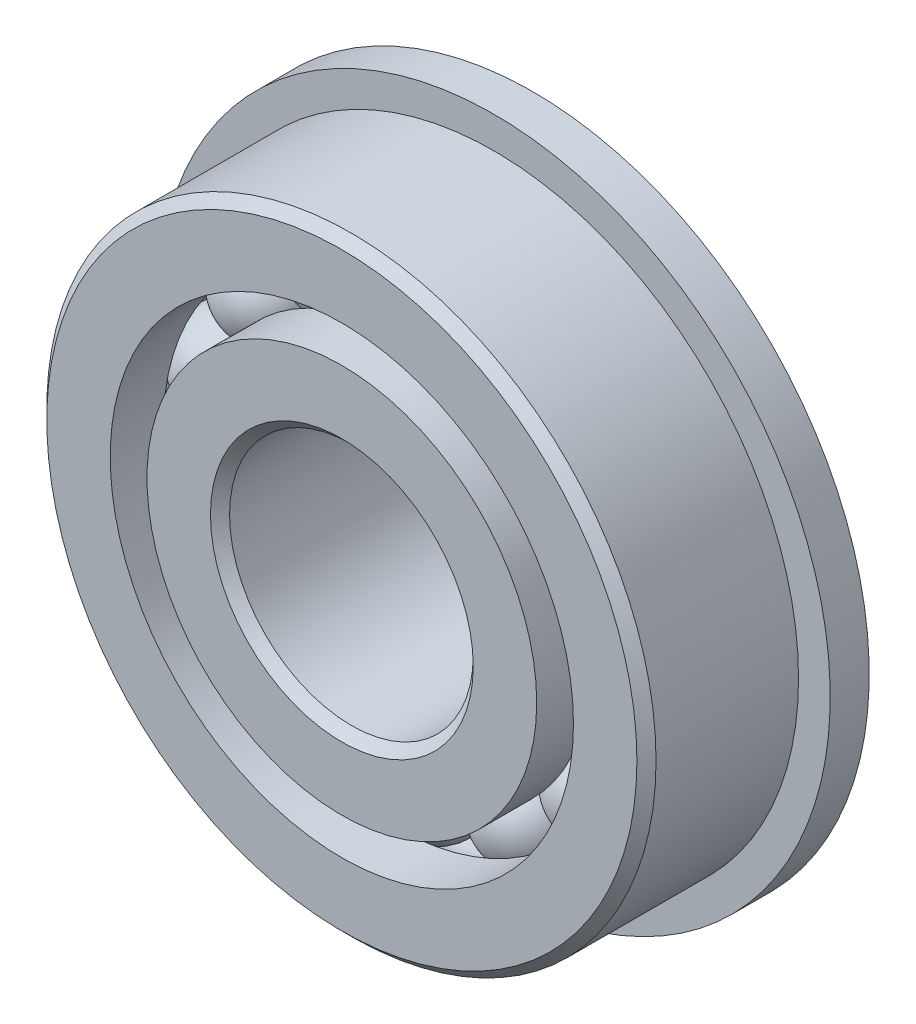
ISO-10303-21;
HEADER;
FILE_DESCRIPTION(('STEP AP214'),'2;1');
FILE_NAME('part.step','',(''),(''),'','','');
FILE_SCHEMA(('AUTOMOTIVE_DESIGN { 1 0 10303 214 1 1 1 1 }'));
ENDSEC;
DATA;
#1=APPLICATION_CONTEXT('core data for automotive mechanical design processes');
#2=APPLICATION_PROTOCOL_DEFINITION('international standard','automotive_design',2000,#1);
#3=PRODUCT_CONTEXT('',#1,'mechanical');
#4=PRODUCT('Part','Part','',(#3));
#5=PRODUCT_RELATED_PRODUCT_CATEGORY('part','',(#4));
#6=PRODUCT_DEFINITION_FORMATION('','',#4);
#7=PRODUCT_DEFINITION_CONTEXT('part definition',#1,'design');
#8=PRODUCT_DEFINITION('design','',#6,#7);
#9=PRODUCT_DEFINITION_SHAPE('','',#8);
#10=(LENGTH_UNIT() NAMED_UNIT(*) SI_UNIT(.MILLI.,.METRE.));
#11=(NAMED_UNIT(*) PLANE_ANGLE_UNIT() SI_UNIT($,.RADIAN.));
#12=(NAMED_UNIT(*) SI_UNIT($,.STERADIAN.) SOLID_ANGLE_UNIT());
#13=UNCERTAINTY_MEASURE_WITH_UNIT(LENGTH_MEASURE(1.E-05),#10,'distance_accuracy_value','');
#14=(GEOMETRIC_REPRESENTATION_CONTEXT(3) GLOBAL_UNCERTAINTY_ASSIGNED_CONTEXT((#13)) GLOBAL_UNIT_ASSIGNED_CONTEXT((#10,
#11,#12)) REPRESENTATION_CONTEXT('',''));
#15=CARTESIAN_POINT('',(0.,0.,0.));
#16=DIRECTION('',(0.,0.,1.));
#17=DIRECTION('',(1.,0.,0.));
#18=AXIS2_PLACEMENT_3D('',#15,#16,#17);
#19=CARTESIAN_POINT('',(-2.41076652547187,5.00600827228285,0.));
#20=DIRECTION('',(0.,0.,1.));
#21=DIRECTION('',(-0.433883739117546,0.900968867902425,0.));
#22=AXIS2_PLACEMENT_3D('',#19,#20,#21);
#23=SPHERICAL_SURFACE('',#22,1.20554465033679);
#24=CARTESIAN_POINT('',(-2.41076652547187,5.00600827228285,1.20554465033679));
#25=VERTEX_POINT('',#24);
#26=VERTEX_LOOP('',#25);
#27=FACE_BOUND('',#26,.T.);
#28=ADVANCED_FACE('F40',(#27),#23,.T.);
#29=CLOSED_SHELL('',(#28));
#30=MANIFOLD_SOLID_BREP('B2',#29);
#31=CARTESIAN_POINT('',(-4.34405117446295,3.46426521157764,0.));
#32=DIRECTION('',(0.,0.,1.));
#33=DIRECTION('',(-0.781831482468022,0.623489801858743,0.));
#34=AXIS2_PLACEMENT_3D('',#31,#32,#33);
#35=SPHERICAL_SURFACE('',#34,1.20554465033679);
#36=CARTESIAN_POINT('',(-4.34405117446295,3.46426521157764,1.20554465033679));
#37=VERTEX_POINT('',#36);
#38=VERTEX_LOOP('',#37);
#39=FACE_BOUND('',#38,.T.);
#40=ADVANCED_FACE('F61',(#39),#35,.T.);
#41=CLOSED_SHELL('',(#40));
#42=MANIFOLD_SOLID_BREP('B6',#41);
#43=CARTESIAN_POINT('',(-5.41694321206024,1.23638193929483,0.));
#44=DIRECTION('',(0.,0.,1.));
#45=DIRECTION('',(-0.974927912181821,0.222520933956325,0.));
#46=AXIS2_PLACEMENT_3D('',#43,#44,#45);
#47=SPHERICAL_SURFACE('',#46,1.20554465033679);
#48=CARTESIAN_POINT('',(-5.41694321206024,1.23638193929483,1.20554465033679));
#49=VERTEX_POINT('',#48);
#50=VERTEX_LOOP('',#49);
#51=FACE_BOUND('',#50,.T.);
#52=ADVANCED_FACE('F82',(#51),#47,.T.);
#53=CLOSED_SHELL('',(#52));
#54=MANIFOLD_SOLID_BREP('B36',#53);
#55=CARTESIAN_POINT('',(-5.41694321206027,-1.23638193929472,0.));
#56=DIRECTION('',(0.,0.,1.));
#57=DIRECTION('',(-0.974927912181826,-0.222520933956305,0.));
#58=AXIS2_PLACEMENT_3D('',#55,#56,#57);
#59=SPHERICAL_SURFACE('',#58,1.20554465033679);
#60=CARTESIAN_POINT('',(-5.41694321206027,-1.23638193929472,1.20554465033679));
#61=VERTEX_POINT('',#60);
#62=VERTEX_LOOP('',#61);
#63=FACE_BOUND('',#62,.T.);
#64=ADVANCED_FACE('F103',(#63),#59,.T.);
#65=CLOSED_SHELL('',(#64));
#66=MANIFOLD_SOLID_BREP('B57',#65);
#67=CARTESIAN_POINT('',(-4.34405117446302,-3.46426521157755,0.));
#68=DIRECTION('',(0.,0.,1.));
#69=DIRECTION('',(-0.781831482468035,-0.623489801858727,0.));
#70=AXIS2_PLACEMENT_3D('',#67,#68,#69);
#71=SPHERICAL_SURFACE('',#70,1.20554465033679);
#72=CARTESIAN_POINT('',(-4.34405117446302,-3.46426521157755,1.20554465033679));
#73=VERTEX_POINT('',#72);
#74=VERTEX_LOOP('',#73);
#75=FACE_BOUND('',#74,.T.);
#76=ADVANCED_FACE('F124',(#75),#71,.T.);
#77=CLOSED_SHELL('',(#76));
#78=MANIFOLD_SOLID_BREP('B78',#77);
#79=CARTESIAN_POINT('',(-2.41076652547197,-5.0060082722828,0.));
#80=DIRECTION('',(0.,0.,1.));
#81=DIRECTION('',(-0.433883739117565,-0.900968867902416,0.));
#82=AXIS2_PLACEMENT_3D('',#79,#80,#81);
#83=SPHERICAL_SURFACE('',#82,1.20554465033679);
#84=CARTESIAN_POINT('',(-2.41076652547197,-5.0060082722828,1.20554465033679));
#85=VERTEX_POINT('',#84);
#86=VERTEX_LOOP('',#85);
#87=FACE_BOUND('',#86,.T.);
#88=ADVANCED_FACE('F145',(#87),#83,.T.);
#89=CLOSED_SHELL('',(#88));
#90=MANIFOLD_SOLID_BREP('B99',#89);
#91=CARTESIAN_POINT('',(0.,-5.55625,0.));
#92=DIRECTION('',(0.,0.,1.));
#93=DIRECTION('',(0.,-1.,0.));
#94=AXIS2_PLACEMENT_3D('',#91,#92,#93);
#95=SPHERICAL_SURFACE('',#94,1.20554465033679);
#96=CARTESIAN_POINT('',(0.,-5.55625,1.20554465033679));
#97=VERTEX_POINT('',#96);
#98=VERTEX_LOOP('',#97);
#99=FACE_BOUND('',#98,.T.);
#100=ADVANCED_FACE('F166',(#99),#95,.T.);
#101=CLOSED_SHELL('',(#100));
#102=MANIFOLD_SOLID_BREP('B120',#101);
#103=CARTESIAN_POINT('',(2.4107665254719,-5.00600827228283,0.));
#104=DIRECTION('',(0.,0.,1.));
#105=DIRECTION('',(0.433883739117553,-0.900968867902422,0.));
#106=AXIS2_PLACEMENT_3D('',#103,#104,#105);
#107=SPHERICAL_SURFACE('',#106,1.20554465033679);
#108=CARTESIAN_POINT('',(2.4107665254719,-5.00600827228283,1.20554465033679));
#109=VERTEX_POINT('',#108);
#110=VERTEX_LOOP('',#109);
#111=FACE_BOUND('',#110,.T.);
#112=ADVANCED_FACE('F187',(#111),#107,.T.);
#113=CLOSED_SHELL('',(#112));
#114=MANIFOLD_SOLID_BREP('B141',#113);
#115=CARTESIAN_POINT('',(4.34405117446297,-3.46426521157761,0.));
#116=DIRECTION('',(0.,0.,1.));
#117=DIRECTION('',(0.781831482468027,-0.623489801858737,0.));
#118=AXIS2_PLACEMENT_3D('',#115,#116,#117);
#119=SPHERICAL_SURFACE('',#118,1.20554465033679);
#120=CARTESIAN_POINT('',(4.34405117446297,-3.46426521157761,1.20554465033679));
#121=VERTEX_POINT('',#120);
#122=VERTEX_LOOP('',#121);
#123=FACE_BOUND('',#122,.T.);
#124=ADVANCED_FACE('F208',(#123),#119,.T.);
#125=CLOSED_SHELL('',(#124));
#126=MANIFOLD_SOLID_BREP('B162',#125);
#127=CARTESIAN_POINT('',(5.41694321206025,-1.23638193929479,0.));
#128=DIRECTION('',(0.,0.,1.));
#129=DIRECTION('',(0.974927912181823,-0.222520933956318,0.));
#130=AXIS2_PLACEMENT_3D('',#127,#128,#129);
#131=SPHERICAL_SURFACE('',#130,1.20554465033679);
#132=CARTESIAN_POINT('',(5.41694321206025,-1.23638193929479,1.20554465033679));
#133=VERTEX_POINT('',#132);
#134=VERTEX_LOOP('',#133);
#135=FACE_BOUND('',#134,.T.);
#136=ADVANCED_FACE('F229',(#135),#131,.T.);
#137=CLOSED_SHELL('',(#136));
#138=MANIFOLD_SOLID_BREP('B183',#137);
#139=CARTESIAN_POINT('',(5.41694321206026,1.23638193929476,0.));
#140=DIRECTION('',(0.,0.,1.));
#141=DIRECTION('',(0.974927912181824,0.222520933956311,0.));
#142=AXIS2_PLACEMENT_3D('',#139,#140,#141);
#143=SPHERICAL_SURFACE('',#142,1.20554465033679);
#144=CARTESIAN_POINT('',(5.41694321206026,1.23638193929476,1.20554465033679));
#145=VERTEX_POINT('',#144);
#146=VERTEX_LOOP('',#145);
#147=FACE_BOUND('',#146,.T.);
#148=ADVANCED_FACE('F250',(#147),#143,.T.);
#149=CLOSED_SHELL('',(#148));
#150=MANIFOLD_SOLID_BREP('B204',#149);
#151=CARTESIAN_POINT('',(4.344051174463,3.46426521157758,0.));
#152=DIRECTION('',(0.,0.,1.));
#153=DIRECTION('',(0.781831482468031,0.623489801858732,0.));
#154=AXIS2_PLACEMENT_3D('',#151,#152,#153);
#155=SPHERICAL_SURFACE('',#154,1.20554465033679);
#156=CARTESIAN_POINT('',(4.344051174463,3.46426521157758,1.20554465033679));
#157=VERTEX_POINT('',#156);
#158=VERTEX_LOOP('',#157);
#159=FACE_BOUND('',#158,.T.);
#160=ADVANCED_FACE('F271',(#159),#155,.T.);
#161=CLOSED_SHELL('',(#160));
#162=MANIFOLD_SOLID_BREP('B225',#161);
#163=CARTESIAN_POINT('',(2.41076652547194,5.00600827228281,0.));
#164=DIRECTION('',(0.,0.,1.));
#165=DIRECTION('',(0.433883739117559,0.900968867902419,0.));
#166=AXIS2_PLACEMENT_3D('',#163,#164,#165);
#167=SPHERICAL_SURFACE('',#166,1.20554465033679);
#168=CARTESIAN_POINT('',(2.41076652547194,5.00600827228281,1.20554465033679));
#169=VERTEX_POINT('',#168);
#170=VERTEX_LOOP('',#169);
#171=FACE_BOUND('',#170,.T.);
#172=ADVANCED_FACE('F292',(#171),#167,.T.);
#173=CLOSED_SHELL('',(#172));
#174=MANIFOLD_SOLID_BREP('B246',#173);
#175=CARTESIAN_POINT('',(0.,5.55625,0.));
#176=DIRECTION('',(0.,0.,1.));
#177=DIRECTION('',(0.,1.,0.));
#178=AXIS2_PLACEMENT_3D('',#175,#176,#177);
#179=SPHERICAL_SURFACE('',#178,1.20554465033679);
#180=CARTESIAN_POINT('',(0.,5.55625,1.20554465033679));
#181=VERTEX_POINT('',#180);
#182=VERTEX_LOOP('',#181);
#183=FACE_BOUND('',#182,.T.);
#184=ADVANCED_FACE('F315',(#183),#179,.T.);
#185=CLOSED_SHELL('',(#184));
#186=MANIFOLD_SOLID_BREP('B267',#185);
#187=CARTESIAN_POINT('',(0.,5.07727857142857,2.4892));
#188=DIRECTION('',(0.,0.,-1.));
#189=DIRECTION('',(-1.,0.,0.));
#190=AXIS2_PLACEMENT_3D('',#187,#188,#189);
#191=PLANE('',#190);
#192=CARTESIAN_POINT('',(0.,0.,2.4892));
#193=DIRECTION('',(0.,0.,1.));
#194=DIRECTION('',(1.,0.,0.));
#195=AXIS2_PLACEMENT_3D('',#192,#193,#194);
#196=CIRCLE('',#195,3.42392);
#197=CARTESIAN_POINT('',(3.42392,0.,2.4892));
#198=VERTEX_POINT('',#197);
#199=EDGE_CURVE('E363',#198,#198,#196,.T.);
#200=ORIENTED_EDGE('',*,*,#199,.F.);
#201=EDGE_LOOP('',(#200));
#202=FACE_BOUND('',#201,.T.);
#203=CARTESIAN_POINT('',(0.,0.,2.4892));
#204=DIRECTION('',(0.,0.,1.));
#205=DIRECTION('',(1.,0.,0.));
#206=AXIS2_PLACEMENT_3D('',#203,#204,#205);
#207=CIRCLE('',#206,5.07727857142857);
#208=CARTESIAN_POINT('',(5.07727857142857,0.,2.4892));
#209=VERTEX_POINT('',#208);
#210=EDGE_CURVE('E314',#209,#209,#207,.T.);
#211=ORIENTED_EDGE('',*,*,#210,.T.);
#212=EDGE_LOOP('',(#211));
#213=FACE_BOUND('',#212,.T.);
#214=ADVANCED_FACE('F335',(#202,#213),#191,.F.);
#215=CARTESIAN_POINT('',(0.,0.,2.4892));
#216=DIRECTION('',(0.,0.,1.));
#217=DIRECTION('',(1.,0.,0.));
#218=AXIS2_PLACEMENT_3D('',#215,#216,#217);
#219=CYLINDRICAL_SURFACE('',#218,5.07727857142857);
#220=ORIENTED_EDGE('',*,*,#210,.F.);
#221=EDGE_LOOP('',(#220));
#222=FACE_BOUND('',#221,.T.);
#223=CARTESIAN_POINT('',(0.,0.,1.10631111111111));
#224=DIRECTION('',(0.,0.,1.));
#225=DIRECTION('',(1.,0.,0.));
#226=AXIS2_PLACEMENT_3D('',#223,#224,#225);
#227=CIRCLE('',#226,5.07727857142857);
#228=CARTESIAN_POINT('',(5.07727857142857,0.,1.10631111111111));
#229=VERTEX_POINT('',#228);
#230=EDGE_CURVE('E341',#229,#229,#227,.T.);
#231=ORIENTED_EDGE('',*,*,#230,.T.);
#232=EDGE_LOOP('',(#231));
#233=FACE_BOUND('',#232,.T.);
#234=ADVANCED_FACE('F370',(#222,#233),#219,.T.);
#235=CARTESIAN_POINT('',(0.,0.,0.));
#236=DIRECTION('',(0.,0.,1.));
#237=DIRECTION('',(1.,0.,0.));
#238=AXIS2_PLACEMENT_3D('',#235,#236,#237);
#239=TOROIDAL_SURFACE('',#238,5.55625,1.20554465033679);
#240=ORIENTED_EDGE('',*,*,#230,.F.);
#241=EDGE_LOOP('',(#240));
#242=FACE_BOUND('',#241,.T.);
#243=CARTESIAN_POINT('',(0.,0.,-1.10631111111111));
#244=DIRECTION('',(0.,0.,1.));
#245=DIRECTION('',(1.,0.,0.));
#246=AXIS2_PLACEMENT_3D('',#243,#244,#245);
#247=CIRCLE('',#246,5.07727857142857);
#248=CARTESIAN_POINT('',(5.07727857142857,0.,-1.10631111111111));
#249=VERTEX_POINT('',#248);
#250=EDGE_CURVE('E345',#249,#249,#247,.T.);
#251=ORIENTED_EDGE('',*,*,#250,.T.);
#252=EDGE_LOOP('',(#251));
#253=FACE_BOUND('',#252,.T.);
#254=ADVANCED_FACE('F374',(#242,#253),#239,.F.);
#255=CARTESIAN_POINT('',(0.,0.,2.4892));
#256=DIRECTION('',(0.,0.,1.));
#257=DIRECTION('',(1.,0.,0.));
#258=AXIS2_PLACEMENT_3D('',#255,#256,#257);
#259=CYLINDRICAL_SURFACE('',#258,5.07727857142857);
#260=ORIENTED_EDGE('',*,*,#250,.F.);
#261=EDGE_LOOP('',(#260));
#262=FACE_BOUND('',#261,.T.);
#263=CARTESIAN_POINT('',(0.,0.,-2.4892));
#264=DIRECTION('',(0.,0.,1.));
#265=DIRECTION('',(1.,0.,0.));
#266=AXIS2_PLACEMENT_3D('',#263,#264,#265);
#267=CIRCLE('',#266,5.07727857142857);
#268=CARTESIAN_POINT('',(5.07727857142857,0.,-2.4892));
#269=VERTEX_POINT('',#268);
#270=EDGE_CURVE('E349',#269,#269,#267,.T.);
#271=ORIENTED_EDGE('',*,*,#270,.T.);
#272=EDGE_LOOP('',(#271));
#273=FACE_BOUND('',#272,.T.);
#274=ADVANCED_FACE('F379',(#262,#273),#259,.T.);
#275=CARTESIAN_POINT('',(0.,3.42392,-2.4892));
#276=DIRECTION('',(0.,0.,1.));
#277=DIRECTION('',(1.,0.,0.));
#278=AXIS2_PLACEMENT_3D('',#275,#276,#277);
#279=PLANE('',#278);
#280=ORIENTED_EDGE('',*,*,#270,.F.);
#281=EDGE_LOOP('',(#280));
#282=FACE_BOUND('',#281,.T.);
#283=CARTESIAN_POINT('',(0.,0.,-2.4892));
#284=DIRECTION('',(0.,0.,1.));
#285=DIRECTION('',(1.,0.,0.));
#286=AXIS2_PLACEMENT_3D('',#283,#284,#285);
#287=CIRCLE('',#286,3.42392);
#288=CARTESIAN_POINT('',(3.42392,0.,-2.4892));
#289=VERTEX_POINT('',#288);
#290=EDGE_CURVE('E354',#289,#289,#287,.T.);
#291=ORIENTED_EDGE('',*,*,#290,.T.);
#292=EDGE_LOOP('',(#291));
#293=FACE_BOUND('',#292,.T.);
#294=ADVANCED_FACE('F385',(#282,#293),#279,.F.);
#295=CARTESIAN_POINT('',(0.,0.,-2.24028));
#296=DIRECTION('',(0.,0.,-1.));
#297=DIRECTION('',(-1.,0.,0.));
#298=AXIS2_PLACEMENT_3D('',#295,#296,#297);
#299=CONICAL_SURFACE('',#298,3.175,0.785398163397447);
#300=ORIENTED_EDGE('',*,*,#290,.F.);
#301=EDGE_LOOP('',(#300));
#302=FACE_BOUND('',#301,.T.);
#303=CARTESIAN_POINT('',(0.,0.,-2.24028));
#304=DIRECTION('',(0.,0.,1.));
#305=DIRECTION('',(1.,0.,0.));
#306=AXIS2_PLACEMENT_3D('',#303,#304,#305);
#307=CIRCLE('',#306,3.175);
#308=CARTESIAN_POINT('',(3.175,0.,-2.24028));
#309=VERTEX_POINT('',#308);
#310=EDGE_CURVE('E357',#309,#309,#307,.T.);
#311=ORIENTED_EDGE('',*,*,#310,.T.);
#312=EDGE_LOOP('',(#311));
#313=FACE_BOUND('',#312,.T.);
#314=ADVANCED_FACE('F389',(#302,#313),#299,.F.);
#315=CARTESIAN_POINT('',(0.,0.,2.4892));
#316=DIRECTION('',(0.,0.,1.));
#317=DIRECTION('',(1.,0.,0.));
#318=AXIS2_PLACEMENT_3D('',#315,#316,#317);
#319=CYLINDRICAL_SURFACE('',#318,3.175);
#320=ORIENTED_EDGE('',*,*,#310,.F.);
#321=EDGE_LOOP('',(#320));
#322=FACE_BOUND('',#321,.T.);
#323=CARTESIAN_POINT('',(0.,0.,2.24028));
#324=DIRECTION('',(0.,0.,1.));
#325=DIRECTION('',(1.,0.,0.));
#326=AXIS2_PLACEMENT_3D('',#323,#324,#325);
#327=CIRCLE('',#326,3.175);
#328=CARTESIAN_POINT('',(3.175,0.,2.24028));
#329=VERTEX_POINT('',#328);
#330=EDGE_CURVE('E360',#329,#329,#327,.T.);
#331=ORIENTED_EDGE('',*,*,#330,.T.);
#332=EDGE_LOOP('',(#331));
#333=FACE_BOUND('',#332,.T.);
#334=ADVANCED_FACE('F393',(#322,#333),#319,.F.);
#335=CARTESIAN_POINT('',(0.,0.,2.4892));
#336=DIRECTION('',(0.,0.,1.));
#337=DIRECTION('',(1.,0.,0.));
#338=AXIS2_PLACEMENT_3D('',#335,#336,#337);
#339=CONICAL_SURFACE('',#338,3.42392,0.785398163397448);
#340=ORIENTED_EDGE('',*,*,#330,.F.);
#341=EDGE_LOOP('',(#340));
#342=FACE_BOUND('',#341,.T.);
#343=ORIENTED_EDGE('',*,*,#199,.T.);
#344=EDGE_LOOP('',(#343));
#345=FACE_BOUND('',#344,.T.);
#346=ADVANCED_FACE('F367',(#342,#345),#339,.F.);
#347=CLOSED_SHELL('',(#214,#234,#254,#274,#294,#314,#334,#346));
#348=MANIFOLD_SOLID_BREP('B288',#347);
#349=CARTESIAN_POINT('',(0.,0.,2.24028));
#350=DIRECTION('',(0.,0.,-1.));
#351=DIRECTION('',(-1.,0.,0.));
#352=AXIS2_PLACEMENT_3D('',#349,#350,#351);
#353=CONICAL_SURFACE('',#352,7.9375,0.785398163397448);
#354=CARTESIAN_POINT('',(0.,0.,2.4892));
#355=DIRECTION('',(0.,0.,1.));
#356=DIRECTION('',(1.,0.,0.));
#357=AXIS2_PLACEMENT_3D('',#354,#355,#356);
#358=CIRCLE('',#357,7.68858);
#359=CARTESIAN_POINT('',(7.68858,0.,2.4892));
#360=VERTEX_POINT('',#359);
#361=EDGE_CURVE('E479',#360,#360,#358,.T.);
#362=ORIENTED_EDGE('',*,*,#361,.F.);
#363=EDGE_LOOP('',(#362));
#364=FACE_BOUND('',#363,.T.);
#365=CARTESIAN_POINT('',(0.,0.,2.24028));
#366=DIRECTION('',(0.,0.,1.));
#367=DIRECTION('',(1.,0.,0.));
#368=AXIS2_PLACEMENT_3D('',#365,#366,#367);
#369=CIRCLE('',#368,7.9375);
#370=CARTESIAN_POINT('',(7.9375,0.,2.24028));
#371=VERTEX_POINT('',#370);
#372=EDGE_CURVE('E334',#371,#371,#369,.T.);
#373=ORIENTED_EDGE('',*,*,#372,.T.);
#374=EDGE_LOOP('',(#373));
#375=FACE_BOUND('',#374,.T.);
#376=ADVANCED_FACE('F457',(#364,#375),#353,.T.);
#377=CARTESIAN_POINT('',(0.,0.,2.4892));
#378=DIRECTION('',(0.,0.,1.));
#379=DIRECTION('',(1.,0.,0.));
#380=AXIS2_PLACEMENT_3D('',#377,#378,#379);
#381=CYLINDRICAL_SURFACE('',#380,7.9375);
#382=CARTESIAN_POINT('',(0.,0.,-1.4732));
#383=DIRECTION('',(0.,0.,1.));
#384=DIRECTION('',(1.,0.,0.));
#385=AXIS2_PLACEMENT_3D('',#382,#383,#384);
#386=CIRCLE('',#385,7.9375);
#387=CARTESIAN_POINT('',(7.9375,0.,-1.4732));
#388=VERTEX_POINT('',#387);
#389=EDGE_CURVE('E460',#388,#388,#386,.T.);
#390=ORIENTED_EDGE('',*,*,#389,.T.);
#391=EDGE_LOOP('',(#390));
#392=FACE_BOUND('',#391,.T.);
#393=ORIENTED_EDGE('',*,*,#372,.F.);
#394=EDGE_LOOP('',(#393));
#395=FACE_BOUND('',#394,.T.);
#396=ADVANCED_FACE('F500',(#392,#395),#381,.T.);
#397=CARTESIAN_POINT('',(0.,7.68858,-2.4892));
#398=DIRECTION('',(0.,0.,1.));
#399=DIRECTION('',(1.,0.,0.));
#400=AXIS2_PLACEMENT_3D('',#397,#398,#399);
#401=PLANE('',#400);
#402=CARTESIAN_POINT('',(0.,0.,-2.4892));
#403=DIRECTION('',(0.,0.,1.));
#404=DIRECTION('',(1.,0.,0.));
#405=AXIS2_PLACEMENT_3D('',#402,#403,#404);
#406=CIRCLE('',#405,6.03522142857143);
#407=CARTESIAN_POINT('',(6.03522142857143,0.,-2.4892));
#408=VERTEX_POINT('',#407);
#409=EDGE_CURVE('E464',#408,#408,#406,.T.);
#410=ORIENTED_EDGE('',*,*,#409,.T.);
#411=EDGE_LOOP('',(#410));
#412=FACE_BOUND('',#411,.T.);
#413=CARTESIAN_POINT('',(0.,0.,-2.4892));
#414=DIRECTION('',(0.,0.,-1.));
#415=DIRECTION('',(-1.,0.,0.));
#416=AXIS2_PLACEMENT_3D('',#413,#414,#415);
#417=CIRCLE('',#416,8.763);
#418=CARTESIAN_POINT('',(-8.763,0.,-2.4892));
#419=VERTEX_POINT('',#418);
#420=EDGE_CURVE('E482',#419,#419,#417,.T.);
#421=ORIENTED_EDGE('',*,*,#420,.T.);
#422=EDGE_LOOP('',(#421));
#423=FACE_BOUND('',#422,.T.);
#424=ADVANCED_FACE('F503',(#412,#423),#401,.F.);
#425=CARTESIAN_POINT('',(0.,0.,2.4892));
#426=DIRECTION('',(0.,0.,1.));
#427=DIRECTION('',(1.,0.,0.));
#428=AXIS2_PLACEMENT_3D('',#425,#426,#427);
#429=CYLINDRICAL_SURFACE('',#428,6.03522142857143);
#430=ORIENTED_EDGE('',*,*,#409,.F.);
#431=EDGE_LOOP('',(#430));
#432=FACE_BOUND('',#431,.T.);
#433=CARTESIAN_POINT('',(0.,0.,-1.10631111111111));
#434=DIRECTION('',(0.,0.,1.));
#435=DIRECTION('',(1.,0.,0.));
#436=AXIS2_PLACEMENT_3D('',#433,#434,#435);
#437=CIRCLE('',#436,6.03522142857143);
#438=CARTESIAN_POINT('',(6.03522142857143,0.,-1.10631111111111));
#439=VERTEX_POINT('',#438);
#440=EDGE_CURVE('E468',#439,#439,#437,.T.);
#441=ORIENTED_EDGE('',*,*,#440,.T.);
#442=EDGE_LOOP('',(#441));
#443=FACE_BOUND('',#442,.T.);
#444=ADVANCED_FACE('F508',(#432,#443),#429,.F.);
#445=CARTESIAN_POINT('',(0.,0.,0.));
#446=DIRECTION('',(0.,0.,1.));
#447=DIRECTION('',(1.,0.,0.));
#448=AXIS2_PLACEMENT_3D('',#445,#446,#447);
#449=TOROIDAL_SURFACE('',#448,5.55625,1.20554465033679);
#450=ORIENTED_EDGE('',*,*,#440,.F.);
#451=EDGE_LOOP('',(#450));
#452=FACE_BOUND('',#451,.T.);
#453=CARTESIAN_POINT('',(0.,0.,1.10631111111111));
#454=DIRECTION('',(0.,0.,1.));
#455=DIRECTION('',(1.,0.,0.));
#456=AXIS2_PLACEMENT_3D('',#453,#454,#455);
#457=CIRCLE('',#456,6.03522142857143);
#458=CARTESIAN_POINT('',(6.03522142857143,0.,1.10631111111111));
#459=VERTEX_POINT('',#458);
#460=EDGE_CURVE('E473',#459,#459,#457,.T.);
#461=ORIENTED_EDGE('',*,*,#460,.T.);
#462=EDGE_LOOP('',(#461));
#463=FACE_BOUND('',#462,.T.);
#464=ADVANCED_FACE('F515',(#452,#463),#449,.F.);
#465=CARTESIAN_POINT('',(0.,0.,2.4892));
#466=DIRECTION('',(0.,0.,1.));
#467=DIRECTION('',(1.,0.,0.));
#468=AXIS2_PLACEMENT_3D('',#465,#466,#467);
#469=CYLINDRICAL_SURFACE('',#468,6.03522142857143);
#470=ORIENTED_EDGE('',*,*,#460,.F.);
#471=EDGE_LOOP('',(#470));
#472=FACE_BOUND('',#471,.T.);
#473=CARTESIAN_POINT('',(0.,0.,2.4892));
#474=DIRECTION('',(0.,0.,1.));
#475=DIRECTION('',(1.,0.,0.));
#476=AXIS2_PLACEMENT_3D('',#473,#474,#475);
#477=CIRCLE('',#476,6.03522142857143);
#478=CARTESIAN_POINT('',(6.03522142857143,0.,2.4892));
#479=VERTEX_POINT('',#478);
#480=EDGE_CURVE('E476',#479,#479,#477,.T.);
#481=ORIENTED_EDGE('',*,*,#480,.T.);
#482=EDGE_LOOP('',(#481));
#483=FACE_BOUND('',#482,.T.);
#484=ADVANCED_FACE('F519',(#472,#483),#469,.F.);
#485=CARTESIAN_POINT('',(0.,7.68858,2.4892));
#486=DIRECTION('',(0.,0.,-1.));
#487=DIRECTION('',(-1.,0.,0.));
#488=AXIS2_PLACEMENT_3D('',#485,#486,#487);
#489=PLANE('',#488);
#490=ORIENTED_EDGE('',*,*,#480,.F.);
#491=EDGE_LOOP('',(#490));
#492=FACE_BOUND('',#491,.T.);
#493=ORIENTED_EDGE('',*,*,#361,.T.);
#494=EDGE_LOOP('',(#493));
#495=FACE_BOUND('',#494,.T.);
#496=ADVANCED_FACE('F495',(#492,#495),#489,.F.);
#497=CARTESIAN_POINT('',(0.,6.86190071428571,-1.4732));
#498=DIRECTION('',(0.,0.,1.));
#499=DIRECTION('',(1.,0.,0.));
#500=AXIS2_PLACEMENT_3D('',#497,#498,#499);
#501=PLANE('',#500);
#502=CARTESIAN_POINT('',(0.,0.,-1.4732));
#503=DIRECTION('',(0.,0.,-1.));
#504=DIRECTION('',(-1.,0.,0.));
#505=AXIS2_PLACEMENT_3D('',#502,#503,#504);
#506=CIRCLE('',#505,8.763);
#507=CARTESIAN_POINT('',(-8.763,0.,-1.4732));
#508=VERTEX_POINT('',#507);
#509=EDGE_CURVE('E485',#508,#508,#506,.T.);
#510=ORIENTED_EDGE('',*,*,#509,.F.);
#511=EDGE_LOOP('',(#510));
#512=FACE_BOUND('',#511,.T.);
#513=ORIENTED_EDGE('',*,*,#389,.F.);
#514=EDGE_LOOP('',(#513));
#515=FACE_BOUND('',#514,.T.);
#516=ADVANCED_FACE('F492',(#512,#515),#501,.T.);
#517=CARTESIAN_POINT('',(0.,0.,-2.4892));
#518=DIRECTION('',(0.,0.,-1.));
#519=DIRECTION('',(-1.,0.,0.));
#520=AXIS2_PLACEMENT_3D('',#517,#518,#519);
#521=CYLINDRICAL_SURFACE('',#520,8.763);
#522=ORIENTED_EDGE('',*,*,#509,.T.);
#523=EDGE_LOOP('',(#522));
#524=FACE_BOUND('',#523,.T.);
#525=ORIENTED_EDGE('',*,*,#420,.F.);
#526=EDGE_LOOP('',(#525));
#527=FACE_BOUND('',#526,.T.);
#528=ADVANCED_FACE('F489',(#524,#527),#521,.T.);
#529=CLOSED_SHELL('',(#376,#396,#424,#444,#464,#484,#496,#516,#528));
#530=MANIFOLD_SOLID_BREP('B309',#529);
#531=ADVANCED_BREP_SHAPE_REPRESENTATION('',(#18,#30,#42,#54,#66,#78,#90,#102,#114,#126,#138,
#150,#162,#174,#186,#348,#530),#14);
#532=SHAPE_DEFINITION_REPRESENTATION(#9,#531);
ENDSEC;
END-ISO-10303-21;
